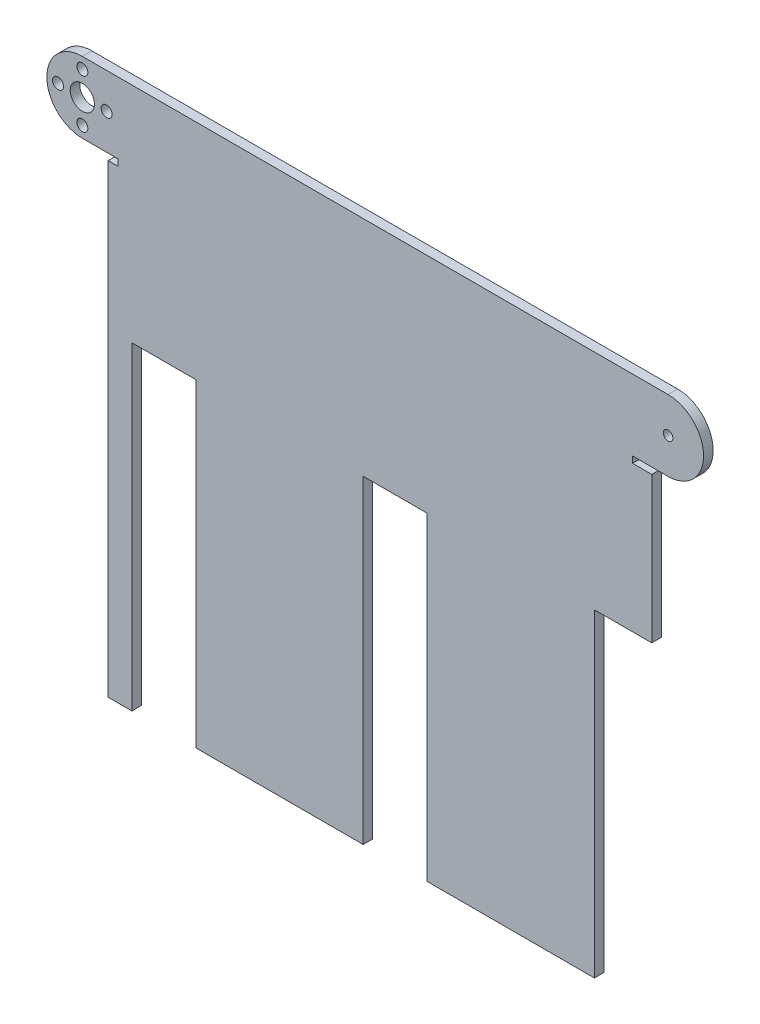
ISO-10303-21;
HEADER;
FILE_DESCRIPTION(('STEP AP214'),'2;1');
FILE_NAME('part.step','',(''),(''),'','','');
FILE_SCHEMA(('AUTOMOTIVE_DESIGN { 1 0 10303 214 1 1 1 1 }'));
ENDSEC;
DATA;
#1=APPLICATION_CONTEXT('core data for automotive mechanical design processes');
#2=APPLICATION_PROTOCOL_DEFINITION('international standard','automotive_design',2000,#1);
#3=PRODUCT_CONTEXT('',#1,'mechanical');
#4=PRODUCT('Part','Part','',(#3));
#5=PRODUCT_RELATED_PRODUCT_CATEGORY('part','',(#4));
#6=PRODUCT_DEFINITION_FORMATION('','',#4);
#7=PRODUCT_DEFINITION_CONTEXT('part definition',#1,'design');
#8=PRODUCT_DEFINITION('design','',#6,#7);
#9=PRODUCT_DEFINITION_SHAPE('','',#8);
#10=(LENGTH_UNIT() NAMED_UNIT(*) SI_UNIT(.MILLI.,.METRE.));
#11=(NAMED_UNIT(*) PLANE_ANGLE_UNIT() SI_UNIT($,.RADIAN.));
#12=(NAMED_UNIT(*) SI_UNIT($,.STERADIAN.) SOLID_ANGLE_UNIT());
#13=UNCERTAINTY_MEASURE_WITH_UNIT(LENGTH_MEASURE(1.E-05),#10,'distance_accuracy_value','');
#14=(GEOMETRIC_REPRESENTATION_CONTEXT(3) GLOBAL_UNCERTAINTY_ASSIGNED_CONTEXT((#13)) GLOBAL_UNIT_ASSIGNED_CONTEXT((#10,
#11,#12)) REPRESENTATION_CONTEXT('',''));
#15=CARTESIAN_POINT('',(0.,0.,0.));
#16=DIRECTION('',(0.,0.,1.));
#17=DIRECTION('',(1.,0.,0.));
#18=AXIS2_PLACEMENT_3D('',#15,#16,#17);
#19=CARTESIAN_POINT('',(11.0904107602412,91.6549457795432,3.));
#20=DIRECTION('',(0.,0.,1.));
#21=DIRECTION('',(1.,0.,0.));
#22=AXIS2_PLACEMENT_3D('',#19,#20,#21);
#23=PLANE('',#22);
#24=CARTESIAN_POINT('',(11.0904107602414,84.0449457795432,3.));
#25=DIRECTION('',(0.,0.,1.));
#26=DIRECTION('',(1.,0.,0.));
#27=AXIS2_PLACEMENT_3D('',#24,#25,#26);
#28=CIRCLE('',#27,1.72500000000001);
#29=CARTESIAN_POINT('',(12.8154107602414,84.0449457795432,3.));
#30=VERTEX_POINT('',#29);
#31=EDGE_CURVE('E428',#30,#30,#28,.T.);
#32=ORIENTED_EDGE('',*,*,#31,.F.);
#33=EDGE_LOOP('',(#32));
#34=FACE_BOUND('',#33,.T.);
#35=CARTESIAN_POINT('',(11.0904107602412,99.2649457795432,3.));
#36=DIRECTION('',(0.,0.,1.));
#37=DIRECTION('',(1.,0.,0.));
#38=AXIS2_PLACEMENT_3D('',#35,#36,#37);
#39=CIRCLE('',#38,1.725);
#40=CARTESIAN_POINT('',(12.8154107602412,99.2649457795432,3.));
#41=VERTEX_POINT('',#40);
#42=EDGE_CURVE('E440',#41,#41,#39,.T.);
#43=ORIENTED_EDGE('',*,*,#42,.F.);
#44=EDGE_LOOP('',(#43));
#45=FACE_BOUND('',#44,.T.);
#46=CARTESIAN_POINT('',(194.780410760241,91.6549457795432,3.));
#47=DIRECTION('',(0.,0.,1.));
#48=DIRECTION('',(1.,0.,0.));
#49=AXIS2_PLACEMENT_3D('',#46,#47,#48);
#50=CIRCLE('',#49,1.5);
#51=CARTESIAN_POINT('',(196.280410760241,91.6549457795432,3.));
#52=VERTEX_POINT('',#51);
#53=EDGE_CURVE('E216',#52,#52,#50,.T.);
#54=ORIENTED_EDGE('',*,*,#53,.F.);
#55=EDGE_LOOP('',(#54));
#56=FACE_BOUND('',#55,.T.);
#57=CARTESIAN_POINT('',(11.0904107602412,91.6549457795432,3.));
#58=DIRECTION('',(0.,0.,1.));
#59=DIRECTION('',(1.,0.,0.));
#60=AXIS2_PLACEMENT_3D('',#57,#58,#59);
#61=CIRCLE('',#60,11.12);
#62=CARTESIAN_POINT('',(11.0904107602412,102.774945779543,3.));
#63=VERTEX_POINT('',#62);
#64=CARTESIAN_POINT('',(11.0904107602412,80.5349457795432,3.));
#65=VERTEX_POINT('',#64);
#66=EDGE_CURVE('E255',#63,#65,#61,.T.);
#67=ORIENTED_EDGE('',*,*,#66,.T.);
#68=DIRECTION('',(1.,0.,0.));
#69=VECTOR('',#68,1.);
#70=CARTESIAN_POINT('',(11.0904107602412,80.5349457795432,3.));
#71=LINE('',#70,#69);
#72=CARTESIAN_POINT('',(22.2104107602412,80.5349457795432,3.));
#73=VERTEX_POINT('',#72);
#74=EDGE_CURVE('E133',#65,#73,#71,.T.);
#75=ORIENTED_EDGE('',*,*,#74,.T.);
#76=DIRECTION('',(0.,-1.,0.));
#77=VECTOR('',#76,1.);
#78=CARTESIAN_POINT('',(22.2104107602412,80.5349457795432,3.));
#79=LINE('',#78,#77);
#80=CARTESIAN_POINT('',(22.2104107602412,78.5349457795432,3.));
#81=VERTEX_POINT('',#80);
#82=EDGE_CURVE('E312',#73,#81,#79,.T.);
#83=ORIENTED_EDGE('',*,*,#82,.T.);
#84=DIRECTION('',(-1.,0.,0.));
#85=VECTOR('',#84,1.);
#86=CARTESIAN_POINT('',(22.2104107602412,78.5349457795432,3.));
#87=LINE('',#86,#85);
#88=CARTESIAN_POINT('',(19.2104107602412,78.5349457795432,3.));
#89=VERTEX_POINT('',#88);
#90=EDGE_CURVE('E331',#81,#89,#87,.T.);
#91=ORIENTED_EDGE('',*,*,#90,.T.);
#92=DIRECTION('',(0.,-1.,0.));
#93=VECTOR('',#92,1.);
#94=CARTESIAN_POINT('',(19.2104107602412,78.5349457795432,3.));
#95=LINE('',#94,#93);
#96=CARTESIAN_POINT('',(19.2104107602413,-67.2250542204568,3.));
#97=VERTEX_POINT('',#96);
#98=EDGE_CURVE('E328',#89,#97,#95,.T.);
#99=ORIENTED_EDGE('',*,*,#98,.T.);
#100=DIRECTION('',(1.,0.,0.));
#101=VECTOR('',#100,1.);
#102=CARTESIAN_POINT('',(19.2104107602413,-67.2250542204568,3.));
#103=LINE('',#102,#101);
#104=CARTESIAN_POINT('',(26.6604107602413,-67.2250542204568,3.));
#105=VERTEX_POINT('',#104);
#106=EDGE_CURVE('E330',#97,#105,#103,.T.);
#107=ORIENTED_EDGE('',*,*,#106,.T.);
#108=DIRECTION('',(0.,1.,0.));
#109=VECTOR('',#108,1.);
#110=CARTESIAN_POINT('',(26.6604107602413,-67.2250542204568,3.));
#111=LINE('',#110,#109);
#112=CARTESIAN_POINT('',(26.6604107602413,32.7749457795432,3.));
#113=VERTEX_POINT('',#112);
#114=EDGE_CURVE('E333',#105,#113,#111,.T.);
#115=ORIENTED_EDGE('',*,*,#114,.T.);
#116=DIRECTION('',(1.,0.,0.));
#117=VECTOR('',#116,1.);
#118=CARTESIAN_POINT('',(26.6604107602413,32.7749457795432,3.));
#119=LINE('',#118,#117);
#120=CARTESIAN_POINT('',(46.6604107602413,32.7749457795432,3.));
#121=VERTEX_POINT('',#120);
#122=EDGE_CURVE('E339',#113,#121,#119,.T.);
#123=ORIENTED_EDGE('',*,*,#122,.T.);
#124=DIRECTION('',(0.,-1.,0.));
#125=VECTOR('',#124,1.);
#126=CARTESIAN_POINT('',(46.6604107602412,-67.2250542204568,3.));
#127=LINE('',#126,#125);
#128=CARTESIAN_POINT('',(46.6604107602412,-67.2250542204568,3.));
#129=VERTEX_POINT('',#128);
#130=EDGE_CURVE('E341',#121,#129,#127,.T.);
#131=ORIENTED_EDGE('',*,*,#130,.T.);
#132=DIRECTION('',(1.,0.,0.));
#133=VECTOR('',#132,1.);
#134=CARTESIAN_POINT('',(46.6604107602412,-67.2250542204568,3.));
#135=LINE('',#134,#133);
#136=CARTESIAN_POINT('',(99.1604107602412,-67.2250542204568,3.));
#137=VERTEX_POINT('',#136);
#138=EDGE_CURVE('E343',#129,#137,#135,.T.);
#139=ORIENTED_EDGE('',*,*,#138,.T.);
#140=DIRECTION('',(0.,1.,0.));
#141=VECTOR('',#140,1.);
#142=CARTESIAN_POINT('',(99.1604107602412,-67.2250542204568,3.));
#143=LINE('',#142,#141);
#144=CARTESIAN_POINT('',(99.1604107602412,32.7749457795432,3.));
#145=VERTEX_POINT('',#144);
#146=EDGE_CURVE('E345',#137,#145,#143,.T.);
#147=ORIENTED_EDGE('',*,*,#146,.T.);
#148=DIRECTION('',(1.,0.,0.));
#149=VECTOR('',#148,1.);
#150=CARTESIAN_POINT('',(99.1604107602412,32.7749457795432,3.));
#151=LINE('',#150,#149);
#152=CARTESIAN_POINT('',(119.160410760241,32.7749457795432,3.));
#153=VERTEX_POINT('',#152);
#154=EDGE_CURVE('E347',#145,#153,#151,.T.);
#155=ORIENTED_EDGE('',*,*,#154,.T.);
#156=DIRECTION('',(0.,-1.,0.));
#157=VECTOR('',#156,1.);
#158=CARTESIAN_POINT('',(119.160410760241,-67.2250542204568,3.));
#159=LINE('',#158,#157);
#160=CARTESIAN_POINT('',(119.160410760241,-67.2250542204568,3.));
#161=VERTEX_POINT('',#160);
#162=EDGE_CURVE('E349',#153,#161,#159,.T.);
#163=ORIENTED_EDGE('',*,*,#162,.T.);
#164=DIRECTION('',(1.,0.,0.));
#165=VECTOR('',#164,1.);
#166=CARTESIAN_POINT('',(119.160410760241,-67.2250542204568,3.));
#167=LINE('',#166,#165);
#168=CARTESIAN_POINT('',(171.660410760241,-67.2250542204568,3.));
#169=VERTEX_POINT('',#168);
#170=EDGE_CURVE('E351',#161,#169,#167,.T.);
#171=ORIENTED_EDGE('',*,*,#170,.T.);
#172=DIRECTION('',(0.,1.,0.));
#173=VECTOR('',#172,1.);
#174=CARTESIAN_POINT('',(171.660410760241,-67.2250542204568,3.));
#175=LINE('',#174,#173);
#176=CARTESIAN_POINT('',(171.660410760241,32.7749457795432,3.));
#177=VERTEX_POINT('',#176);
#178=EDGE_CURVE('E353',#169,#177,#175,.T.);
#179=ORIENTED_EDGE('',*,*,#178,.T.);
#180=DIRECTION('',(1.,0.,0.));
#181=VECTOR('',#180,1.);
#182=CARTESIAN_POINT('',(171.660410760241,32.7749457795432,3.));
#183=LINE('',#182,#181);
#184=CARTESIAN_POINT('',(189.660410760241,32.7749457795432,3.));
#185=VERTEX_POINT('',#184);
#186=EDGE_CURVE('E355',#177,#185,#183,.T.);
#187=ORIENTED_EDGE('',*,*,#186,.T.);
#188=DIRECTION('',(0.,1.,0.));
#189=VECTOR('',#188,1.);
#190=CARTESIAN_POINT('',(189.660410760241,32.7749457795432,3.));
#191=LINE('',#190,#189);
#192=CARTESIAN_POINT('',(189.660410760241,78.5349457795432,3.));
#193=VERTEX_POINT('',#192);
#194=EDGE_CURVE('E357',#185,#193,#191,.T.);
#195=ORIENTED_EDGE('',*,*,#194,.T.);
#196=DIRECTION('',(-1.,0.,0.));
#197=VECTOR('',#196,1.);
#198=CARTESIAN_POINT('',(189.660410760241,78.5349457795432,3.));
#199=LINE('',#198,#197);
#200=CARTESIAN_POINT('',(183.660410760241,78.5349457795432,3.));
#201=VERTEX_POINT('',#200);
#202=EDGE_CURVE('E359',#193,#201,#199,.T.);
#203=ORIENTED_EDGE('',*,*,#202,.T.);
#204=DIRECTION('',(0.,1.,0.));
#205=VECTOR('',#204,1.);
#206=CARTESIAN_POINT('',(183.660410760241,78.5349457795432,3.));
#207=LINE('',#206,#205);
#208=CARTESIAN_POINT('',(183.660410760241,80.5349457795432,3.));
#209=VERTEX_POINT('',#208);
#210=EDGE_CURVE('E194',#201,#209,#207,.T.);
#211=ORIENTED_EDGE('',*,*,#210,.T.);
#212=DIRECTION('',(1.,0.,0.));
#213=VECTOR('',#212,1.);
#214=CARTESIAN_POINT('',(183.660410760241,80.5349457795432,3.));
#215=LINE('',#214,#213);
#216=CARTESIAN_POINT('',(194.780410760241,80.5349457795432,3.));
#217=VERTEX_POINT('',#216);
#218=EDGE_CURVE('E188',#209,#217,#215,.T.);
#219=ORIENTED_EDGE('',*,*,#218,.T.);
#220=CARTESIAN_POINT('',(194.780410760241,91.6549457795432,3.));
#221=DIRECTION('',(0.,0.,1.));
#222=DIRECTION('',(1.,0.,0.));
#223=AXIS2_PLACEMENT_3D('',#220,#221,#222);
#224=CIRCLE('',#223,11.12);
#225=CARTESIAN_POINT('',(194.780410760241,102.774945779543,3.));
#226=VERTEX_POINT('',#225);
#227=EDGE_CURVE('E192',#217,#226,#224,.T.);
#228=ORIENTED_EDGE('',*,*,#227,.T.);
#229=DIRECTION('',(-1.,0.,0.));
#230=VECTOR('',#229,1.);
#231=CARTESIAN_POINT('',(11.0904107602412,102.774945779543,3.));
#232=LINE('',#231,#230);
#233=EDGE_CURVE('E48',#226,#63,#232,.T.);
#234=ORIENTED_EDGE('',*,*,#233,.T.);
#235=EDGE_LOOP('',(#67,#75,#83,#91,#99,#107,#115,#123,#131,#139,#147,#155,#163,#171,#179,#187,
#195,#203,#211,#219,#228,#234));
#236=FACE_BOUND('',#235,.T.);
#237=CARTESIAN_POINT('',(11.0904107602412,91.6549457795432,3.));
#238=DIRECTION('',(0.,0.,1.));
#239=DIRECTION('',(1.,0.,0.));
#240=AXIS2_PLACEMENT_3D('',#237,#238,#239);
#241=CIRCLE('',#240,3.8);
#242=CARTESIAN_POINT('',(14.8904107602412,91.6549457795432,3.));
#243=VERTEX_POINT('',#242);
#244=EDGE_CURVE('E446',#243,#243,#241,.T.);
#245=ORIENTED_EDGE('',*,*,#244,.F.);
#246=EDGE_LOOP('',(#245));
#247=FACE_BOUND('',#246,.T.);
#248=CARTESIAN_POINT('',(18.7004107602413,91.6549457795433,3.));
#249=DIRECTION('',(0.,0.,1.));
#250=DIRECTION('',(1.,0.,0.));
#251=AXIS2_PLACEMENT_3D('',#248,#249,#250);
#252=CIRCLE('',#251,1.72500000000001);
#253=CARTESIAN_POINT('',(20.4254107602413,91.6549457795433,3.));
#254=VERTEX_POINT('',#253);
#255=EDGE_CURVE('E434',#254,#254,#252,.T.);
#256=ORIENTED_EDGE('',*,*,#255,.F.);
#257=EDGE_LOOP('',(#256));
#258=FACE_BOUND('',#257,.T.);
#259=CARTESIAN_POINT('',(3.4804107602413,91.6549457795432,3.));
#260=DIRECTION('',(0.,0.,1.));
#261=DIRECTION('',(1.,0.,0.));
#262=AXIS2_PLACEMENT_3D('',#259,#260,#261);
#263=CIRCLE('',#262,1.725);
#264=CARTESIAN_POINT('',(5.20541076024131,91.6549457795432,3.));
#265=VERTEX_POINT('',#264);
#266=EDGE_CURVE('E419',#265,#265,#263,.T.);
#267=ORIENTED_EDGE('',*,*,#266,.F.);
#268=EDGE_LOOP('',(#267));
#269=FACE_BOUND('',#268,.T.);
#270=ADVANCED_FACE('F31',(#34,#45,#56,#236,#247,#258,#269),#23,.T.);
#271=CARTESIAN_POINT('',(11.0904107602412,91.6549457795432,0.));
#272=DIRECTION('',(0.,0.,1.));
#273=DIRECTION('',(1.,0.,0.));
#274=AXIS2_PLACEMENT_3D('',#271,#272,#273);
#275=PLANE('',#274);
#276=CARTESIAN_POINT('',(11.0904107602414,84.0449457795432,0.));
#277=DIRECTION('',(0.,0.,1.));
#278=DIRECTION('',(1.,0.,0.));
#279=AXIS2_PLACEMENT_3D('',#276,#277,#278);
#280=CIRCLE('',#279,1.72500000000001);
#281=CARTESIAN_POINT('',(12.8154107602414,84.0449457795432,0.));
#282=VERTEX_POINT('',#281);
#283=EDGE_CURVE('E425',#282,#282,#280,.T.);
#284=ORIENTED_EDGE('',*,*,#283,.T.);
#285=EDGE_LOOP('',(#284));
#286=FACE_BOUND('',#285,.T.);
#287=CARTESIAN_POINT('',(11.0904107602412,99.2649457795432,0.));
#288=DIRECTION('',(0.,0.,1.));
#289=DIRECTION('',(1.,0.,0.));
#290=AXIS2_PLACEMENT_3D('',#287,#288,#289);
#291=CIRCLE('',#290,1.725);
#292=CARTESIAN_POINT('',(12.8154107602412,99.2649457795432,0.));
#293=VERTEX_POINT('',#292);
#294=EDGE_CURVE('E437',#293,#293,#291,.T.);
#295=ORIENTED_EDGE('',*,*,#294,.T.);
#296=EDGE_LOOP('',(#295));
#297=FACE_BOUND('',#296,.T.);
#298=CARTESIAN_POINT('',(194.780410760241,91.6549457795432,0.));
#299=DIRECTION('',(0.,0.,1.));
#300=DIRECTION('',(1.,0.,0.));
#301=AXIS2_PLACEMENT_3D('',#298,#299,#300);
#302=CIRCLE('',#301,1.5);
#303=CARTESIAN_POINT('',(196.280410760241,91.6549457795432,0.));
#304=VERTEX_POINT('',#303);
#305=EDGE_CURVE('E449',#304,#304,#302,.T.);
#306=ORIENTED_EDGE('',*,*,#305,.T.);
#307=EDGE_LOOP('',(#306));
#308=FACE_BOUND('',#307,.T.);
#309=CARTESIAN_POINT('',(11.0904107602412,91.6549457795432,0.));
#310=DIRECTION('',(0.,0.,1.));
#311=DIRECTION('',(1.,0.,0.));
#312=AXIS2_PLACEMENT_3D('',#309,#310,#311);
#313=CIRCLE('',#312,11.12);
#314=CARTESIAN_POINT('',(11.0904107602412,102.774945779543,0.));
#315=VERTEX_POINT('',#314);
#316=CARTESIAN_POINT('',(11.0904107602412,80.5349457795432,0.));
#317=VERTEX_POINT('',#316);
#318=EDGE_CURVE('E212',#315,#317,#313,.T.);
#319=ORIENTED_EDGE('',*,*,#318,.F.);
#320=DIRECTION('',(-1.,0.,0.));
#321=VECTOR('',#320,1.);
#322=CARTESIAN_POINT('',(11.0904107602412,102.774945779543,0.));
#323=LINE('',#322,#321);
#324=CARTESIAN_POINT('',(194.780410760241,102.774945779543,0.));
#325=VERTEX_POINT('',#324);
#326=EDGE_CURVE('E125',#325,#315,#323,.T.);
#327=ORIENTED_EDGE('',*,*,#326,.F.);
#328=CARTESIAN_POINT('',(194.780410760241,91.6549457795432,0.));
#329=DIRECTION('',(0.,0.,1.));
#330=DIRECTION('',(1.,0.,0.));
#331=AXIS2_PLACEMENT_3D('',#328,#329,#330);
#332=CIRCLE('',#331,11.12);
#333=CARTESIAN_POINT('',(194.780410760241,80.5349457795432,0.));
#334=VERTEX_POINT('',#333);
#335=EDGE_CURVE('E119',#334,#325,#332,.T.);
#336=ORIENTED_EDGE('',*,*,#335,.F.);
#337=DIRECTION('',(1.,0.,0.));
#338=VECTOR('',#337,1.);
#339=CARTESIAN_POINT('',(183.660410760241,80.5349457795432,0.));
#340=LINE('',#339,#338);
#341=CARTESIAN_POINT('',(183.660410760241,80.5349457795432,0.));
#342=VERTEX_POINT('',#341);
#343=EDGE_CURVE('E202',#342,#334,#340,.T.);
#344=ORIENTED_EDGE('',*,*,#343,.F.);
#345=DIRECTION('',(0.,1.,0.));
#346=VECTOR('',#345,1.);
#347=CARTESIAN_POINT('',(183.660410760241,78.5349457795432,0.));
#348=LINE('',#347,#346);
#349=CARTESIAN_POINT('',(183.660410760241,78.5349457795432,0.));
#350=VERTEX_POINT('',#349);
#351=EDGE_CURVE('E250',#350,#342,#348,.T.);
#352=ORIENTED_EDGE('',*,*,#351,.F.);
#353=DIRECTION('',(-1.,0.,0.));
#354=VECTOR('',#353,1.);
#355=CARTESIAN_POINT('',(189.660410760241,78.5349457795432,0.));
#356=LINE('',#355,#354);
#357=CARTESIAN_POINT('',(189.660410760241,78.5349457795432,0.));
#358=VERTEX_POINT('',#357);
#359=EDGE_CURVE('E248',#358,#350,#356,.T.);
#360=ORIENTED_EDGE('',*,*,#359,.F.);
#361=DIRECTION('',(0.,1.,0.));
#362=VECTOR('',#361,1.);
#363=CARTESIAN_POINT('',(189.660410760241,32.7749457795432,0.));
#364=LINE('',#363,#362);
#365=CARTESIAN_POINT('',(189.660410760241,32.7749457795432,0.));
#366=VERTEX_POINT('',#365);
#367=EDGE_CURVE('E246',#366,#358,#364,.T.);
#368=ORIENTED_EDGE('',*,*,#367,.F.);
#369=DIRECTION('',(1.,0.,0.));
#370=VECTOR('',#369,1.);
#371=CARTESIAN_POINT('',(171.660410760241,32.7749457795432,0.));
#372=LINE('',#371,#370);
#373=CARTESIAN_POINT('',(171.660410760241,32.7749457795432,0.));
#374=VERTEX_POINT('',#373);
#375=EDGE_CURVE('E244',#374,#366,#372,.T.);
#376=ORIENTED_EDGE('',*,*,#375,.F.);
#377=DIRECTION('',(0.,1.,0.));
#378=VECTOR('',#377,1.);
#379=CARTESIAN_POINT('',(171.660410760241,-67.2250542204568,0.));
#380=LINE('',#379,#378);
#381=CARTESIAN_POINT('',(171.660410760241,-67.2250542204568,0.));
#382=VERTEX_POINT('',#381);
#383=EDGE_CURVE('E242',#382,#374,#380,.T.);
#384=ORIENTED_EDGE('',*,*,#383,.F.);
#385=DIRECTION('',(1.,0.,0.));
#386=VECTOR('',#385,1.);
#387=CARTESIAN_POINT('',(119.160410760241,-67.2250542204568,0.));
#388=LINE('',#387,#386);
#389=CARTESIAN_POINT('',(119.160410760241,-67.2250542204568,0.));
#390=VERTEX_POINT('',#389);
#391=EDGE_CURVE('E240',#390,#382,#388,.T.);
#392=ORIENTED_EDGE('',*,*,#391,.F.);
#393=DIRECTION('',(0.,-1.,0.));
#394=VECTOR('',#393,1.);
#395=CARTESIAN_POINT('',(119.160410760241,-67.2250542204568,0.));
#396=LINE('',#395,#394);
#397=CARTESIAN_POINT('',(119.160410760241,32.7749457795432,0.));
#398=VERTEX_POINT('',#397);
#399=EDGE_CURVE('E238',#398,#390,#396,.T.);
#400=ORIENTED_EDGE('',*,*,#399,.F.);
#401=DIRECTION('',(1.,0.,0.));
#402=VECTOR('',#401,1.);
#403=CARTESIAN_POINT('',(99.1604107602412,32.7749457795432,0.));
#404=LINE('',#403,#402);
#405=CARTESIAN_POINT('',(99.1604107602412,32.7749457795432,0.));
#406=VERTEX_POINT('',#405);
#407=EDGE_CURVE('E236',#406,#398,#404,.T.);
#408=ORIENTED_EDGE('',*,*,#407,.F.);
#409=DIRECTION('',(0.,1.,0.));
#410=VECTOR('',#409,1.);
#411=CARTESIAN_POINT('',(99.1604107602412,-67.2250542204568,0.));
#412=LINE('',#411,#410);
#413=CARTESIAN_POINT('',(99.1604107602412,-67.2250542204568,0.));
#414=VERTEX_POINT('',#413);
#415=EDGE_CURVE('E234',#414,#406,#412,.T.);
#416=ORIENTED_EDGE('',*,*,#415,.F.);
#417=DIRECTION('',(1.,0.,0.));
#418=VECTOR('',#417,1.);
#419=CARTESIAN_POINT('',(46.6604107602412,-67.2250542204568,0.));
#420=LINE('',#419,#418);
#421=CARTESIAN_POINT('',(46.6604107602412,-67.2250542204568,0.));
#422=VERTEX_POINT('',#421);
#423=EDGE_CURVE('E232',#422,#414,#420,.T.);
#424=ORIENTED_EDGE('',*,*,#423,.F.);
#425=DIRECTION('',(0.,-1.,0.));
#426=VECTOR('',#425,1.);
#427=CARTESIAN_POINT('',(46.6604107602412,-67.2250542204568,0.));
#428=LINE('',#427,#426);
#429=CARTESIAN_POINT('',(46.6604107602413,32.7749457795432,0.));
#430=VERTEX_POINT('',#429);
#431=EDGE_CURVE('E230',#430,#422,#428,.T.);
#432=ORIENTED_EDGE('',*,*,#431,.F.);
#433=DIRECTION('',(1.,0.,0.));
#434=VECTOR('',#433,1.);
#435=CARTESIAN_POINT('',(26.6604107602413,32.7749457795432,0.));
#436=LINE('',#435,#434);
#437=CARTESIAN_POINT('',(26.6604107602413,32.7749457795432,0.));
#438=VERTEX_POINT('',#437);
#439=EDGE_CURVE('E228',#438,#430,#436,.T.);
#440=ORIENTED_EDGE('',*,*,#439,.F.);
#441=DIRECTION('',(0.,1.,0.));
#442=VECTOR('',#441,1.);
#443=CARTESIAN_POINT('',(26.6604107602413,-67.2250542204568,0.));
#444=LINE('',#443,#442);
#445=CARTESIAN_POINT('',(26.6604107602413,-67.2250542204568,0.));
#446=VERTEX_POINT('',#445);
#447=EDGE_CURVE('E226',#446,#438,#444,.T.);
#448=ORIENTED_EDGE('',*,*,#447,.F.);
#449=DIRECTION('',(1.,0.,0.));
#450=VECTOR('',#449,1.);
#451=CARTESIAN_POINT('',(19.2104107602413,-67.2250542204568,0.));
#452=LINE('',#451,#450);
#453=CARTESIAN_POINT('',(19.2104107602413,-67.2250542204568,0.));
#454=VERTEX_POINT('',#453);
#455=EDGE_CURVE('E224',#454,#446,#452,.T.);
#456=ORIENTED_EDGE('',*,*,#455,.F.);
#457=DIRECTION('',(0.,-1.,0.));
#458=VECTOR('',#457,1.);
#459=CARTESIAN_POINT('',(19.2104107602412,78.5349457795432,0.));
#460=LINE('',#459,#458);
#461=CARTESIAN_POINT('',(19.2104107602412,78.5349457795432,0.));
#462=VERTEX_POINT('',#461);
#463=EDGE_CURVE('E222',#462,#454,#460,.T.);
#464=ORIENTED_EDGE('',*,*,#463,.F.);
#465=DIRECTION('',(-1.,0.,0.));
#466=VECTOR('',#465,1.);
#467=CARTESIAN_POINT('',(22.2104107602412,78.5349457795432,0.));
#468=LINE('',#467,#466);
#469=CARTESIAN_POINT('',(22.2104107602412,78.5349457795432,0.));
#470=VERTEX_POINT('',#469);
#471=EDGE_CURVE('E220',#470,#462,#468,.T.);
#472=ORIENTED_EDGE('',*,*,#471,.F.);
#473=DIRECTION('',(0.,-1.,0.));
#474=VECTOR('',#473,1.);
#475=CARTESIAN_POINT('',(22.2104107602412,80.5349457795432,0.));
#476=LINE('',#475,#474);
#477=CARTESIAN_POINT('',(22.2104107602412,80.5349457795432,0.));
#478=VERTEX_POINT('',#477);
#479=EDGE_CURVE('E218',#478,#470,#476,.T.);
#480=ORIENTED_EDGE('',*,*,#479,.F.);
#481=DIRECTION('',(1.,0.,0.));
#482=VECTOR('',#481,1.);
#483=CARTESIAN_POINT('',(11.0904107602412,80.5349457795432,0.));
#484=LINE('',#483,#482);
#485=EDGE_CURVE('E215',#317,#478,#484,.T.);
#486=ORIENTED_EDGE('',*,*,#485,.F.);
#487=EDGE_LOOP('',(#319,#327,#336,#344,#352,#360,#368,#376,#384,#392,#400,#408,#416,#424,#432,
#440,#448,#456,#464,#472,#480,#486));
#488=FACE_BOUND('',#487,.T.);
#489=CARTESIAN_POINT('',(11.0904107602412,91.6549457795432,0.));
#490=DIRECTION('',(0.,0.,1.));
#491=DIRECTION('',(1.,0.,0.));
#492=AXIS2_PLACEMENT_3D('',#489,#490,#491);
#493=CIRCLE('',#492,3.8);
#494=CARTESIAN_POINT('',(14.8904107602412,91.6549457795432,0.));
#495=VERTEX_POINT('',#494);
#496=EDGE_CURVE('E443',#495,#495,#493,.T.);
#497=ORIENTED_EDGE('',*,*,#496,.T.);
#498=EDGE_LOOP('',(#497));
#499=FACE_BOUND('',#498,.T.);
#500=CARTESIAN_POINT('',(18.7004107602413,91.6549457795433,0.));
#501=DIRECTION('',(0.,0.,1.));
#502=DIRECTION('',(1.,0.,0.));
#503=AXIS2_PLACEMENT_3D('',#500,#501,#502);
#504=CIRCLE('',#503,1.72500000000001);
#505=CARTESIAN_POINT('',(20.4254107602413,91.6549457795433,0.));
#506=VERTEX_POINT('',#505);
#507=EDGE_CURVE('E431',#506,#506,#504,.T.);
#508=ORIENTED_EDGE('',*,*,#507,.T.);
#509=EDGE_LOOP('',(#508));
#510=FACE_BOUND('',#509,.T.);
#511=CARTESIAN_POINT('',(3.4804107602413,91.6549457795432,0.));
#512=DIRECTION('',(0.,0.,1.));
#513=DIRECTION('',(1.,0.,0.));
#514=AXIS2_PLACEMENT_3D('',#511,#512,#513);
#515=CIRCLE('',#514,1.725);
#516=CARTESIAN_POINT('',(5.20541076024131,91.6549457795432,0.));
#517=VERTEX_POINT('',#516);
#518=EDGE_CURVE('E422',#517,#517,#515,.T.);
#519=ORIENTED_EDGE('',*,*,#518,.T.);
#520=EDGE_LOOP('',(#519));
#521=FACE_BOUND('',#520,.T.);
#522=ADVANCED_FACE('F316',(#286,#297,#308,#488,#499,#510,#521),#275,.F.);
#523=CARTESIAN_POINT('',(11.0904107602412,91.6549457795432,3.));
#524=DIRECTION('',(0.,0.,-1.));
#525=DIRECTION('',(-1.,0.,0.));
#526=AXIS2_PLACEMENT_3D('',#523,#524,#525);
#527=CYLINDRICAL_SURFACE('',#526,11.12);
#528=ORIENTED_EDGE('',*,*,#318,.T.);
#529=DIRECTION('',(0.,0.,-1.));
#530=VECTOR('',#529,1.);
#531=CARTESIAN_POINT('',(11.0904107602412,80.5349457795432,3.));
#532=LINE('',#531,#530);
#533=EDGE_CURVE('E11',#65,#317,#532,.T.);
#534=ORIENTED_EDGE('',*,*,#533,.F.);
#535=ORIENTED_EDGE('',*,*,#66,.F.);
#536=DIRECTION('',(0.,0.,-1.));
#537=VECTOR('',#536,1.);
#538=CARTESIAN_POINT('',(11.0904107602412,102.774945779543,3.));
#539=LINE('',#538,#537);
#540=EDGE_CURVE('E208',#63,#315,#539,.T.);
#541=ORIENTED_EDGE('',*,*,#540,.T.);
#542=EDGE_LOOP('',(#528,#534,#535,#541));
#543=FACE_BOUND('',#542,.T.);
#544=ADVANCED_FACE('F33',(#543),#527,.T.);
#545=CARTESIAN_POINT('',(11.0904107602412,80.5349457795432,3.));
#546=DIRECTION('',(0.,1.,0.));
#547=DIRECTION('',(0.,0.,1.));
#548=AXIS2_PLACEMENT_3D('',#545,#546,#547);
#549=PLANE('',#548);
#550=ORIENTED_EDGE('',*,*,#485,.T.);
#551=DIRECTION('',(0.,0.,-1.));
#552=VECTOR('',#551,1.);
#553=CARTESIAN_POINT('',(22.2104107602412,80.5349457795432,3.));
#554=LINE('',#553,#552);
#555=EDGE_CURVE('E40',#73,#478,#554,.T.);
#556=ORIENTED_EDGE('',*,*,#555,.F.);
#557=ORIENTED_EDGE('',*,*,#74,.F.);
#558=ORIENTED_EDGE('',*,*,#533,.T.);
#559=EDGE_LOOP('',(#550,#556,#557,#558));
#560=FACE_BOUND('',#559,.T.);
#561=ADVANCED_FACE('F676',(#560),#549,.F.);
#562=CARTESIAN_POINT('',(22.2104107602412,80.5349457795432,3.));
#563=DIRECTION('',(1.,0.,0.));
#564=DIRECTION('',(0.,0.,-1.));
#565=AXIS2_PLACEMENT_3D('',#562,#563,#564);
#566=PLANE('',#565);
#567=ORIENTED_EDGE('',*,*,#479,.T.);
#568=DIRECTION('',(0.,0.,-1.));
#569=VECTOR('',#568,1.);
#570=CARTESIAN_POINT('',(22.2104107602412,78.5349457795432,3.));
#571=LINE('',#570,#569);
#572=EDGE_CURVE('E304',#81,#470,#571,.T.);
#573=ORIENTED_EDGE('',*,*,#572,.F.);
#574=ORIENTED_EDGE('',*,*,#82,.F.);
#575=ORIENTED_EDGE('',*,*,#555,.T.);
#576=EDGE_LOOP('',(#567,#573,#574,#575));
#577=FACE_BOUND('',#576,.T.);
#578=ADVANCED_FACE('F310',(#577),#566,.F.);
#579=CARTESIAN_POINT('',(22.2104107602412,78.5349457795432,3.));
#580=DIRECTION('',(0.,-1.,0.));
#581=DIRECTION('',(0.,0.,-1.));
#582=AXIS2_PLACEMENT_3D('',#579,#580,#581);
#583=PLANE('',#582);
#584=ORIENTED_EDGE('',*,*,#471,.T.);
#585=DIRECTION('',(0.,0.,-1.));
#586=VECTOR('',#585,1.);
#587=CARTESIAN_POINT('',(19.2104107602412,78.5349457795432,3.));
#588=LINE('',#587,#586);
#589=EDGE_CURVE('E301',#89,#462,#588,.T.);
#590=ORIENTED_EDGE('',*,*,#589,.F.);
#591=ORIENTED_EDGE('',*,*,#90,.F.);
#592=ORIENTED_EDGE('',*,*,#572,.T.);
#593=EDGE_LOOP('',(#584,#590,#591,#592));
#594=FACE_BOUND('',#593,.T.);
#595=ADVANCED_FACE('F322',(#594),#583,.F.);
#596=CARTESIAN_POINT('',(19.2104107602412,78.5349457795432,3.));
#597=DIRECTION('',(1.,0.,0.));
#598=DIRECTION('',(0.,1.,0.));
#599=AXIS2_PLACEMENT_3D('',#596,#597,#598);
#600=PLANE('',#599);
#601=ORIENTED_EDGE('',*,*,#463,.T.);
#602=DIRECTION('',(0.,0.,-1.));
#603=VECTOR('',#602,1.);
#604=CARTESIAN_POINT('',(19.2104107602413,-67.2250542204568,3.));
#605=LINE('',#604,#603);
#606=EDGE_CURVE('E298',#97,#454,#605,.T.);
#607=ORIENTED_EDGE('',*,*,#606,.F.);
#608=ORIENTED_EDGE('',*,*,#98,.F.);
#609=ORIENTED_EDGE('',*,*,#589,.T.);
#610=EDGE_LOOP('',(#601,#607,#608,#609));
#611=FACE_BOUND('',#610,.T.);
#612=ADVANCED_FACE('F326',(#611),#600,.F.);
#613=CARTESIAN_POINT('',(19.2104107602413,-67.2250542204568,3.));
#614=DIRECTION('',(0.,1.,0.));
#615=DIRECTION('',(0.,0.,1.));
#616=AXIS2_PLACEMENT_3D('',#613,#614,#615);
#617=PLANE('',#616);
#618=ORIENTED_EDGE('',*,*,#455,.T.);
#619=DIRECTION('',(0.,0.,-1.));
#620=VECTOR('',#619,1.);
#621=CARTESIAN_POINT('',(26.6604107602413,-67.2250542204568,3.));
#622=LINE('',#621,#620);
#623=EDGE_CURVE('E295',#105,#446,#622,.T.);
#624=ORIENTED_EDGE('',*,*,#623,.F.);
#625=ORIENTED_EDGE('',*,*,#106,.F.);
#626=ORIENTED_EDGE('',*,*,#606,.T.);
#627=EDGE_LOOP('',(#618,#624,#625,#626));
#628=FACE_BOUND('',#627,.T.);
#629=ADVANCED_FACE('F641',(#628),#617,.F.);
#630=CARTESIAN_POINT('',(26.6604107602413,-67.2250542204568,3.));
#631=DIRECTION('',(-1.,0.,0.));
#632=DIRECTION('',(0.,-1.,0.));
#633=AXIS2_PLACEMENT_3D('',#630,#631,#632);
#634=PLANE('',#633);
#635=ORIENTED_EDGE('',*,*,#447,.T.);
#636=DIRECTION('',(0.,0.,-1.));
#637=VECTOR('',#636,1.);
#638=CARTESIAN_POINT('',(26.6604107602413,32.7749457795432,3.));
#639=LINE('',#638,#637);
#640=EDGE_CURVE('E292',#113,#438,#639,.T.);
#641=ORIENTED_EDGE('',*,*,#640,.F.);
#642=ORIENTED_EDGE('',*,*,#114,.F.);
#643=ORIENTED_EDGE('',*,*,#623,.T.);
#644=EDGE_LOOP('',(#635,#641,#642,#643));
#645=FACE_BOUND('',#644,.T.);
#646=ADVANCED_FACE('F631',(#645),#634,.F.);
#647=CARTESIAN_POINT('',(26.6604107602413,32.7749457795432,3.));
#648=DIRECTION('',(0.,1.,0.));
#649=DIRECTION('',(0.,0.,1.));
#650=AXIS2_PLACEMENT_3D('',#647,#648,#649);
#651=PLANE('',#650);
#652=ORIENTED_EDGE('',*,*,#439,.T.);
#653=DIRECTION('',(0.,0.,-1.));
#654=VECTOR('',#653,1.);
#655=CARTESIAN_POINT('',(46.6604107602413,32.7749457795432,3.));
#656=LINE('',#655,#654);
#657=EDGE_CURVE('E289',#121,#430,#656,.T.);
#658=ORIENTED_EDGE('',*,*,#657,.F.);
#659=ORIENTED_EDGE('',*,*,#122,.F.);
#660=ORIENTED_EDGE('',*,*,#640,.T.);
#661=EDGE_LOOP('',(#652,#658,#659,#660));
#662=FACE_BOUND('',#661,.T.);
#663=ADVANCED_FACE('F621',(#662),#651,.F.);
#664=CARTESIAN_POINT('',(46.6604107602412,-67.2250542204568,3.));
#665=DIRECTION('',(1.,0.,0.));
#666=DIRECTION('',(0.,1.,0.));
#667=AXIS2_PLACEMENT_3D('',#664,#665,#666);
#668=PLANE('',#667);
#669=ORIENTED_EDGE('',*,*,#431,.T.);
#670=DIRECTION('',(0.,0.,-1.));
#671=VECTOR('',#670,1.);
#672=CARTESIAN_POINT('',(46.6604107602412,-67.2250542204568,3.));
#673=LINE('',#672,#671);
#674=EDGE_CURVE('E286',#129,#422,#673,.T.);
#675=ORIENTED_EDGE('',*,*,#674,.F.);
#676=ORIENTED_EDGE('',*,*,#130,.F.);
#677=ORIENTED_EDGE('',*,*,#657,.T.);
#678=EDGE_LOOP('',(#669,#675,#676,#677));
#679=FACE_BOUND('',#678,.T.);
#680=ADVANCED_FACE('F611',(#679),#668,.F.);
#681=CARTESIAN_POINT('',(46.6604107602412,-67.2250542204568,3.));
#682=DIRECTION('',(0.,1.,0.));
#683=DIRECTION('',(0.,0.,1.));
#684=AXIS2_PLACEMENT_3D('',#681,#682,#683);
#685=PLANE('',#684);
#686=ORIENTED_EDGE('',*,*,#423,.T.);
#687=DIRECTION('',(0.,0.,-1.));
#688=VECTOR('',#687,1.);
#689=CARTESIAN_POINT('',(99.1604107602412,-67.2250542204568,3.));
#690=LINE('',#689,#688);
#691=EDGE_CURVE('E283',#137,#414,#690,.T.);
#692=ORIENTED_EDGE('',*,*,#691,.F.);
#693=ORIENTED_EDGE('',*,*,#138,.F.);
#694=ORIENTED_EDGE('',*,*,#674,.T.);
#695=EDGE_LOOP('',(#686,#692,#693,#694));
#696=FACE_BOUND('',#695,.T.);
#697=ADVANCED_FACE('F601',(#696),#685,.F.);
#698=CARTESIAN_POINT('',(99.1604107602412,-67.2250542204568,3.));
#699=DIRECTION('',(-1.,0.,0.));
#700=DIRECTION('',(0.,-1.,0.));
#701=AXIS2_PLACEMENT_3D('',#698,#699,#700);
#702=PLANE('',#701);
#703=ORIENTED_EDGE('',*,*,#415,.T.);
#704=DIRECTION('',(0.,0.,-1.));
#705=VECTOR('',#704,1.);
#706=CARTESIAN_POINT('',(99.1604107602412,32.7749457795432,3.));
#707=LINE('',#706,#705);
#708=EDGE_CURVE('E280',#145,#406,#707,.T.);
#709=ORIENTED_EDGE('',*,*,#708,.F.);
#710=ORIENTED_EDGE('',*,*,#146,.F.);
#711=ORIENTED_EDGE('',*,*,#691,.T.);
#712=EDGE_LOOP('',(#703,#709,#710,#711));
#713=FACE_BOUND('',#712,.T.);
#714=ADVANCED_FACE('F591',(#713),#702,.F.);
#715=CARTESIAN_POINT('',(99.1604107602412,32.7749457795432,3.));
#716=DIRECTION('',(0.,1.,0.));
#717=DIRECTION('',(0.,0.,1.));
#718=AXIS2_PLACEMENT_3D('',#715,#716,#717);
#719=PLANE('',#718);
#720=ORIENTED_EDGE('',*,*,#407,.T.);
#721=DIRECTION('',(0.,0.,-1.));
#722=VECTOR('',#721,1.);
#723=CARTESIAN_POINT('',(119.160410760241,32.7749457795432,3.));
#724=LINE('',#723,#722);
#725=EDGE_CURVE('E277',#153,#398,#724,.T.);
#726=ORIENTED_EDGE('',*,*,#725,.F.);
#727=ORIENTED_EDGE('',*,*,#154,.F.);
#728=ORIENTED_EDGE('',*,*,#708,.T.);
#729=EDGE_LOOP('',(#720,#726,#727,#728));
#730=FACE_BOUND('',#729,.T.);
#731=ADVANCED_FACE('F581',(#730),#719,.F.);
#732=CARTESIAN_POINT('',(119.160410760241,-67.2250542204568,3.));
#733=DIRECTION('',(1.,0.,0.));
#734=DIRECTION('',(0.,1.,0.));
#735=AXIS2_PLACEMENT_3D('',#732,#733,#734);
#736=PLANE('',#735);
#737=ORIENTED_EDGE('',*,*,#399,.T.);
#738=DIRECTION('',(0.,0.,-1.));
#739=VECTOR('',#738,1.);
#740=CARTESIAN_POINT('',(119.160410760241,-67.2250542204568,3.));
#741=LINE('',#740,#739);
#742=EDGE_CURVE('E274',#161,#390,#741,.T.);
#743=ORIENTED_EDGE('',*,*,#742,.F.);
#744=ORIENTED_EDGE('',*,*,#162,.F.);
#745=ORIENTED_EDGE('',*,*,#725,.T.);
#746=EDGE_LOOP('',(#737,#743,#744,#745));
#747=FACE_BOUND('',#746,.T.);
#748=ADVANCED_FACE('F571',(#747),#736,.F.);
#749=CARTESIAN_POINT('',(119.160410760241,-67.2250542204568,3.));
#750=DIRECTION('',(0.,1.,0.));
#751=DIRECTION('',(0.,0.,1.));
#752=AXIS2_PLACEMENT_3D('',#749,#750,#751);
#753=PLANE('',#752);
#754=ORIENTED_EDGE('',*,*,#391,.T.);
#755=DIRECTION('',(0.,0.,-1.));
#756=VECTOR('',#755,1.);
#757=CARTESIAN_POINT('',(171.660410760241,-67.2250542204568,3.));
#758=LINE('',#757,#756);
#759=EDGE_CURVE('E271',#169,#382,#758,.T.);
#760=ORIENTED_EDGE('',*,*,#759,.F.);
#761=ORIENTED_EDGE('',*,*,#170,.F.);
#762=ORIENTED_EDGE('',*,*,#742,.T.);
#763=EDGE_LOOP('',(#754,#760,#761,#762));
#764=FACE_BOUND('',#763,.T.);
#765=ADVANCED_FACE('F561',(#764),#753,.F.);
#766=CARTESIAN_POINT('',(171.660410760241,-67.2250542204568,3.));
#767=DIRECTION('',(-1.,0.,0.));
#768=DIRECTION('',(0.,-1.,0.));
#769=AXIS2_PLACEMENT_3D('',#766,#767,#768);
#770=PLANE('',#769);
#771=ORIENTED_EDGE('',*,*,#383,.T.);
#772=DIRECTION('',(0.,0.,-1.));
#773=VECTOR('',#772,1.);
#774=CARTESIAN_POINT('',(171.660410760241,32.7749457795432,3.));
#775=LINE('',#774,#773);
#776=EDGE_CURVE('E268',#177,#374,#775,.T.);
#777=ORIENTED_EDGE('',*,*,#776,.F.);
#778=ORIENTED_EDGE('',*,*,#178,.F.);
#779=ORIENTED_EDGE('',*,*,#759,.T.);
#780=EDGE_LOOP('',(#771,#777,#778,#779));
#781=FACE_BOUND('',#780,.T.);
#782=ADVANCED_FACE('F551',(#781),#770,.F.);
#783=CARTESIAN_POINT('',(171.660410760241,32.7749457795432,3.));
#784=DIRECTION('',(0.,1.,0.));
#785=DIRECTION('',(0.,0.,1.));
#786=AXIS2_PLACEMENT_3D('',#783,#784,#785);
#787=PLANE('',#786);
#788=ORIENTED_EDGE('',*,*,#375,.T.);
#789=DIRECTION('',(0.,0.,-1.));
#790=VECTOR('',#789,1.);
#791=CARTESIAN_POINT('',(189.660410760241,32.7749457795432,3.));
#792=LINE('',#791,#790);
#793=EDGE_CURVE('E265',#185,#366,#792,.T.);
#794=ORIENTED_EDGE('',*,*,#793,.F.);
#795=ORIENTED_EDGE('',*,*,#186,.F.);
#796=ORIENTED_EDGE('',*,*,#776,.T.);
#797=EDGE_LOOP('',(#788,#794,#795,#796));
#798=FACE_BOUND('',#797,.T.);
#799=ADVANCED_FACE('F541',(#798),#787,.F.);
#800=CARTESIAN_POINT('',(189.660410760241,32.7749457795432,3.));
#801=DIRECTION('',(-1.,0.,0.));
#802=DIRECTION('',(0.,-1.,0.));
#803=AXIS2_PLACEMENT_3D('',#800,#801,#802);
#804=PLANE('',#803);
#805=ORIENTED_EDGE('',*,*,#367,.T.);
#806=DIRECTION('',(0.,0.,-1.));
#807=VECTOR('',#806,1.);
#808=CARTESIAN_POINT('',(189.660410760241,78.5349457795432,3.));
#809=LINE('',#808,#807);
#810=EDGE_CURVE('E262',#193,#358,#809,.T.);
#811=ORIENTED_EDGE('',*,*,#810,.F.);
#812=ORIENTED_EDGE('',*,*,#194,.F.);
#813=ORIENTED_EDGE('',*,*,#793,.T.);
#814=EDGE_LOOP('',(#805,#811,#812,#813));
#815=FACE_BOUND('',#814,.T.);
#816=ADVANCED_FACE('F532',(#815),#804,.F.);
#817=CARTESIAN_POINT('',(189.660410760241,78.5349457795432,3.));
#818=DIRECTION('',(0.,-1.,0.));
#819=DIRECTION('',(1.,0.,0.));
#820=AXIS2_PLACEMENT_3D('',#817,#818,#819);
#821=PLANE('',#820);
#822=ORIENTED_EDGE('',*,*,#359,.T.);
#823=DIRECTION('',(0.,0.,-1.));
#824=VECTOR('',#823,1.);
#825=CARTESIAN_POINT('',(183.660410760241,78.5349457795432,3.));
#826=LINE('',#825,#824);
#827=EDGE_CURVE('E259',#201,#350,#826,.T.);
#828=ORIENTED_EDGE('',*,*,#827,.F.);
#829=ORIENTED_EDGE('',*,*,#202,.F.);
#830=ORIENTED_EDGE('',*,*,#810,.T.);
#831=EDGE_LOOP('',(#822,#828,#829,#830));
#832=FACE_BOUND('',#831,.T.);
#833=ADVANCED_FACE('F365',(#832),#821,.F.);
#834=CARTESIAN_POINT('',(183.660410760241,78.5349457795432,3.));
#835=DIRECTION('',(-1.,0.,0.));
#836=DIRECTION('',(0.,0.,1.));
#837=AXIS2_PLACEMENT_3D('',#834,#835,#836);
#838=PLANE('',#837);
#839=ORIENTED_EDGE('',*,*,#351,.T.);
#840=DIRECTION('',(0.,0.,-1.));
#841=VECTOR('',#840,1.);
#842=CARTESIAN_POINT('',(183.660410760241,80.5349457795432,3.));
#843=LINE('',#842,#841);
#844=EDGE_CURVE('E203',#209,#342,#843,.T.);
#845=ORIENTED_EDGE('',*,*,#844,.F.);
#846=ORIENTED_EDGE('',*,*,#210,.F.);
#847=ORIENTED_EDGE('',*,*,#827,.T.);
#848=EDGE_LOOP('',(#839,#845,#846,#847));
#849=FACE_BOUND('',#848,.T.);
#850=ADVANCED_FACE('F369',(#849),#838,.F.);
#851=CARTESIAN_POINT('',(183.660410760241,80.5349457795432,3.));
#852=DIRECTION('',(0.,1.,0.));
#853=DIRECTION('',(-1.,0.,0.));
#854=AXIS2_PLACEMENT_3D('',#851,#852,#853);
#855=PLANE('',#854);
#856=ORIENTED_EDGE('',*,*,#343,.T.);
#857=DIRECTION('',(0.,0.,-1.));
#858=VECTOR('',#857,1.);
#859=CARTESIAN_POINT('',(194.780410760241,80.5349457795432,3.));
#860=LINE('',#859,#858);
#861=EDGE_CURVE('E199',#217,#334,#860,.T.);
#862=ORIENTED_EDGE('',*,*,#861,.F.);
#863=ORIENTED_EDGE('',*,*,#218,.F.);
#864=ORIENTED_EDGE('',*,*,#844,.T.);
#865=EDGE_LOOP('',(#856,#862,#863,#864));
#866=FACE_BOUND('',#865,.T.);
#867=ADVANCED_FACE('F200',(#866),#855,.F.);
#868=CARTESIAN_POINT('',(194.780410760241,91.6549457795432,3.));
#869=DIRECTION('',(0.,0.,-1.));
#870=DIRECTION('',(-1.,0.,0.));
#871=AXIS2_PLACEMENT_3D('',#868,#869,#870);
#872=CYLINDRICAL_SURFACE('',#871,11.12);
#873=ORIENTED_EDGE('',*,*,#335,.T.);
#874=DIRECTION('',(0.,0.,-1.));
#875=VECTOR('',#874,1.);
#876=CARTESIAN_POINT('',(194.780410760241,102.774945779543,3.));
#877=LINE('',#876,#875);
#878=EDGE_CURVE('E204',#226,#325,#877,.T.);
#879=ORIENTED_EDGE('',*,*,#878,.F.);
#880=ORIENTED_EDGE('',*,*,#227,.F.);
#881=ORIENTED_EDGE('',*,*,#861,.T.);
#882=EDGE_LOOP('',(#873,#879,#880,#881));
#883=FACE_BOUND('',#882,.T.);
#884=ADVANCED_FACE('F206',(#883),#872,.T.);
#885=CARTESIAN_POINT('',(11.0904107602412,102.774945779543,3.));
#886=DIRECTION('',(0.,-1.,0.));
#887=DIRECTION('',(1.,0.,0.));
#888=AXIS2_PLACEMENT_3D('',#885,#886,#887);
#889=PLANE('',#888);
#890=ORIENTED_EDGE('',*,*,#326,.T.);
#891=ORIENTED_EDGE('',*,*,#540,.F.);
#892=ORIENTED_EDGE('',*,*,#233,.F.);
#893=ORIENTED_EDGE('',*,*,#878,.T.);
#894=EDGE_LOOP('',(#890,#891,#892,#893));
#895=FACE_BOUND('',#894,.T.);
#896=ADVANCED_FACE('F373',(#895),#889,.F.);
#897=CARTESIAN_POINT('',(194.780410760241,91.6549457795432,3.));
#898=DIRECTION('',(0.,0.,-1.));
#899=DIRECTION('',(-1.,0.,0.));
#900=AXIS2_PLACEMENT_3D('',#897,#898,#899);
#901=CYLINDRICAL_SURFACE('',#900,1.5);
#902=ORIENTED_EDGE('',*,*,#53,.T.);
#903=EDGE_LOOP('',(#902));
#904=FACE_BOUND('',#903,.T.);
#905=ORIENTED_EDGE('',*,*,#305,.F.);
#906=EDGE_LOOP('',(#905));
#907=FACE_BOUND('',#906,.T.);
#908=ADVANCED_FACE('F375',(#904,#907),#901,.F.);
#909=CARTESIAN_POINT('',(11.0904107602412,91.6549457795432,3.));
#910=DIRECTION('',(0.,0.,-1.));
#911=DIRECTION('',(-1.,0.,0.));
#912=AXIS2_PLACEMENT_3D('',#909,#910,#911);
#913=CYLINDRICAL_SURFACE('',#912,3.8);
#914=ORIENTED_EDGE('',*,*,#244,.T.);
#915=EDGE_LOOP('',(#914));
#916=FACE_BOUND('',#915,.T.);
#917=ORIENTED_EDGE('',*,*,#496,.F.);
#918=EDGE_LOOP('',(#917));
#919=FACE_BOUND('',#918,.T.);
#920=ADVANCED_FACE('F381',(#916,#919),#913,.F.);
#921=CARTESIAN_POINT('',(11.0904107602412,99.2649457795432,3.));
#922=DIRECTION('',(0.,0.,-1.));
#923=DIRECTION('',(-1.,0.,0.));
#924=AXIS2_PLACEMENT_3D('',#921,#922,#923);
#925=CYLINDRICAL_SURFACE('',#924,1.725);
#926=ORIENTED_EDGE('',*,*,#42,.T.);
#927=EDGE_LOOP('',(#926));
#928=FACE_BOUND('',#927,.T.);
#929=ORIENTED_EDGE('',*,*,#294,.F.);
#930=EDGE_LOOP('',(#929));
#931=FACE_BOUND('',#930,.T.);
#932=ADVANCED_FACE('F398',(#928,#931),#925,.F.);
#933=CARTESIAN_POINT('',(18.7004107602413,91.6549457795433,3.));
#934=DIRECTION('',(0.,0.,-1.));
#935=DIRECTION('',(-1.,0.,0.));
#936=AXIS2_PLACEMENT_3D('',#933,#934,#935);
#937=CYLINDRICAL_SURFACE('',#936,1.72500000000001);
#938=ORIENTED_EDGE('',*,*,#255,.T.);
#939=EDGE_LOOP('',(#938));
#940=FACE_BOUND('',#939,.T.);
#941=ORIENTED_EDGE('',*,*,#507,.F.);
#942=EDGE_LOOP('',(#941));
#943=FACE_BOUND('',#942,.T.);
#944=ADVANCED_FACE('F402',(#940,#943),#937,.F.);
#945=CARTESIAN_POINT('',(11.0904107602414,84.0449457795432,3.));
#946=DIRECTION('',(0.,0.,-1.));
#947=DIRECTION('',(-1.,0.,0.));
#948=AXIS2_PLACEMENT_3D('',#945,#946,#947);
#949=CYLINDRICAL_SURFACE('',#948,1.72500000000001);
#950=ORIENTED_EDGE('',*,*,#31,.T.);
#951=EDGE_LOOP('',(#950));
#952=FACE_BOUND('',#951,.T.);
#953=ORIENTED_EDGE('',*,*,#283,.F.);
#954=EDGE_LOOP('',(#953));
#955=FACE_BOUND('',#954,.T.);
#956=ADVANCED_FACE('F406',(#952,#955),#949,.F.);
#957=CARTESIAN_POINT('',(3.4804107602413,91.6549457795432,3.));
#958=DIRECTION('',(0.,0.,-1.));
#959=DIRECTION('',(-1.,0.,0.));
#960=AXIS2_PLACEMENT_3D('',#957,#958,#959);
#961=CYLINDRICAL_SURFACE('',#960,1.725);
#962=ORIENTED_EDGE('',*,*,#266,.T.);
#963=EDGE_LOOP('',(#962));
#964=FACE_BOUND('',#963,.T.);
#965=ORIENTED_EDGE('',*,*,#518,.F.);
#966=EDGE_LOOP('',(#965));
#967=FACE_BOUND('',#966,.T.);
#968=ADVANCED_FACE('F410',(#964,#967),#961,.F.);
#969=CLOSED_SHELL('',(#270,#522,#544,#561,#578,#595,#612,#629,#646,#663,#680,#697,#714,#731,
#748,#765,#782,#799,#816,#833,#850,#867,#884,#896,#908,#920,#932,#944,#956,#968));
#970=MANIFOLD_SOLID_BREP('B2',#969);
#971=ADVANCED_BREP_SHAPE_REPRESENTATION('',(#18,#970),#14);
#972=SHAPE_DEFINITION_REPRESENTATION(#9,#971);
ENDSEC;
END-ISO-10303-21;
